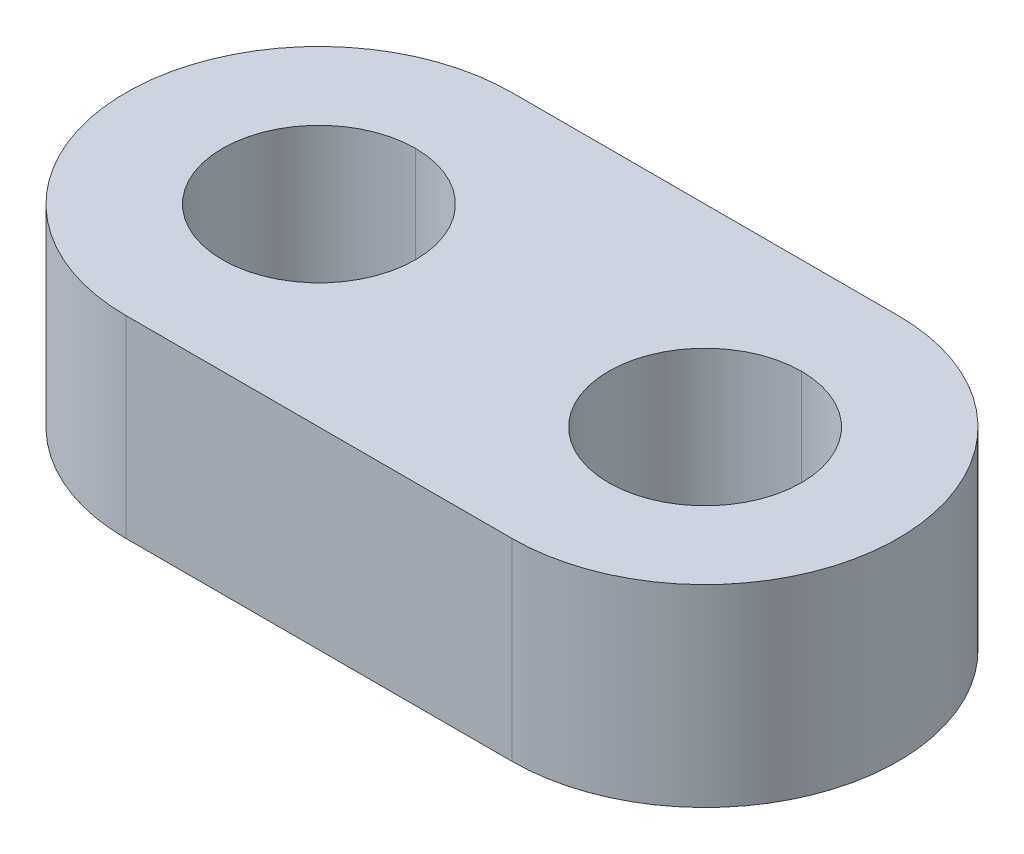
ISO-10303-21;
HEADER;
FILE_DESCRIPTION(('STEP AP214'),'2;1');
FILE_NAME('part.step','',(''),(''),'','','');
FILE_SCHEMA(('AUTOMOTIVE_DESIGN { 1 0 10303 214 1 1 1 1 }'));
ENDSEC;
DATA;
#1=APPLICATION_CONTEXT('core data for automotive mechanical design processes');
#2=APPLICATION_PROTOCOL_DEFINITION('international standard','automotive_design',2000,#1);
#3=PRODUCT_CONTEXT('',#1,'mechanical');
#4=PRODUCT('Part','Part','',(#3));
#5=PRODUCT_RELATED_PRODUCT_CATEGORY('part','',(#4));
#6=PRODUCT_DEFINITION_FORMATION('','',#4);
#7=PRODUCT_DEFINITION_CONTEXT('part definition',#1,'design');
#8=PRODUCT_DEFINITION('design','',#6,#7);
#9=PRODUCT_DEFINITION_SHAPE('','',#8);
#10=(LENGTH_UNIT() NAMED_UNIT(*) SI_UNIT(.MILLI.,.METRE.));
#11=(NAMED_UNIT(*) PLANE_ANGLE_UNIT() SI_UNIT($,.RADIAN.));
#12=(NAMED_UNIT(*) SI_UNIT($,.STERADIAN.) SOLID_ANGLE_UNIT());
#13=UNCERTAINTY_MEASURE_WITH_UNIT(LENGTH_MEASURE(1.E-05),#10,'distance_accuracy_value','');
#14=(GEOMETRIC_REPRESENTATION_CONTEXT(3) GLOBAL_UNCERTAINTY_ASSIGNED_CONTEXT((#13)) GLOBAL_UNIT_ASSIGNED_CONTEXT((#10,
#11,#12)) REPRESENTATION_CONTEXT('',''));
#15=CARTESIAN_POINT('',(0.,0.,0.));
#16=DIRECTION('',(0.,0.,1.));
#17=DIRECTION('',(1.,0.,0.));
#18=AXIS2_PLACEMENT_3D('',#15,#16,#17);
#19=CARTESIAN_POINT('',(4.,4.,0.));
#20=DIRECTION('',(0.,1.,0.));
#21=DIRECTION('',(0.,0.,1.));
#22=AXIS2_PLACEMENT_3D('',#19,#20,#21);
#23=CYLINDRICAL_SURFACE('',#22,2.);
#24=DIRECTION('',(0.,1.,0.));
#25=VECTOR('',#24,1.);
#26=CARTESIAN_POINT('',(4.,4.,-2.));
#27=LINE('',#26,#25);
#28=CARTESIAN_POINT('',(4.,0.,-2.));
#29=VERTEX_POINT('',#28);
#30=CARTESIAN_POINT('',(4.,4.,-2.));
#31=VERTEX_POINT('',#30);
#32=EDGE_CURVE('E134',#29,#31,#27,.T.);
#33=ORIENTED_EDGE('',*,*,#32,.F.);
#34=CARTESIAN_POINT('',(4.,0.,0.));
#35=DIRECTION('',(0.,1.,0.));
#36=DIRECTION('',(0.,0.,1.));
#37=AXIS2_PLACEMENT_3D('',#34,#35,#36);
#38=CIRCLE('',#37,2.);
#39=CARTESIAN_POINT('',(4.,0.,2.));
#40=VERTEX_POINT('',#39);
#41=EDGE_CURVE('E26',#40,#29,#38,.T.);
#42=ORIENTED_EDGE('',*,*,#41,.F.);
#43=DIRECTION('',(0.,1.,0.));
#44=VECTOR('',#43,1.);
#45=CARTESIAN_POINT('',(4.,4.,2.));
#46=LINE('',#45,#44);
#47=CARTESIAN_POINT('',(4.,4.,2.));
#48=VERTEX_POINT('',#47);
#49=EDGE_CURVE('E156',#40,#48,#46,.T.);
#50=ORIENTED_EDGE('',*,*,#49,.T.);
#51=CARTESIAN_POINT('',(4.,4.,0.));
#52=DIRECTION('',(0.,1.,0.));
#53=DIRECTION('',(0.,0.,1.));
#54=AXIS2_PLACEMENT_3D('',#51,#52,#53);
#55=CIRCLE('',#54,2.);
#56=EDGE_CURVE('E175',#48,#31,#55,.T.);
#57=ORIENTED_EDGE('',*,*,#56,.T.);
#58=EDGE_LOOP('',(#33,#42,#50,#57));
#59=FACE_BOUND('',#58,.T.);
#60=ADVANCED_FACE('F15',(#59),#23,.F.);
#61=CARTESIAN_POINT('',(-4.,4.,0.));
#62=DIRECTION('',(0.,1.,0.));
#63=DIRECTION('',(0.,0.,1.));
#64=AXIS2_PLACEMENT_3D('',#61,#62,#63);
#65=CYLINDRICAL_SURFACE('',#64,2.);
#66=DIRECTION('',(0.,1.,0.));
#67=VECTOR('',#66,1.);
#68=CARTESIAN_POINT('',(-4.,4.,-2.));
#69=LINE('',#68,#67);
#70=CARTESIAN_POINT('',(-4.,0.,-2.));
#71=VERTEX_POINT('',#70);
#72=CARTESIAN_POINT('',(-4.,4.,-2.));
#73=VERTEX_POINT('',#72);
#74=EDGE_CURVE('E142',#71,#73,#69,.T.);
#75=ORIENTED_EDGE('',*,*,#74,.F.);
#76=CARTESIAN_POINT('',(-4.,0.,0.));
#77=DIRECTION('',(0.,1.,0.));
#78=DIRECTION('',(0.,0.,1.));
#79=AXIS2_PLACEMENT_3D('',#76,#77,#78);
#80=CIRCLE('',#79,2.);
#81=CARTESIAN_POINT('',(-4.,0.,2.));
#82=VERTEX_POINT('',#81);
#83=EDGE_CURVE('E10',#82,#71,#80,.T.);
#84=ORIENTED_EDGE('',*,*,#83,.F.);
#85=DIRECTION('',(0.,1.,0.));
#86=VECTOR('',#85,1.);
#87=CARTESIAN_POINT('',(-4.,4.,2.));
#88=LINE('',#87,#86);
#89=CARTESIAN_POINT('',(-4.,4.,2.));
#90=VERTEX_POINT('',#89);
#91=EDGE_CURVE('E19',#82,#90,#88,.T.);
#92=ORIENTED_EDGE('',*,*,#91,.T.);
#93=CARTESIAN_POINT('',(-4.,4.,0.));
#94=DIRECTION('',(0.,1.,0.));
#95=DIRECTION('',(0.,0.,1.));
#96=AXIS2_PLACEMENT_3D('',#93,#94,#95);
#97=CIRCLE('',#96,2.);
#98=EDGE_CURVE('E74',#90,#73,#97,.T.);
#99=ORIENTED_EDGE('',*,*,#98,.T.);
#100=EDGE_LOOP('',(#75,#84,#92,#99));
#101=FACE_BOUND('',#100,.T.);
#102=ADVANCED_FACE('F204',(#101),#65,.F.);
#103=CARTESIAN_POINT('',(-4.,0.,0.));
#104=DIRECTION('',(0.,1.,0.));
#105=DIRECTION('',(1.,0.,0.));
#106=AXIS2_PLACEMENT_3D('',#103,#104,#105);
#107=PLANE('',#106);
#108=ORIENTED_EDGE('',*,*,#83,.T.);
#109=CARTESIAN_POINT('',(-4.,0.,0.));
#110=DIRECTION('',(0.,1.,0.));
#111=DIRECTION('',(0.,0.,1.));
#112=AXIS2_PLACEMENT_3D('',#109,#110,#111);
#113=CIRCLE('',#112,2.);
#114=EDGE_CURVE('E147',#71,#82,#113,.T.);
#115=ORIENTED_EDGE('',*,*,#114,.T.);
#116=EDGE_LOOP('',(#108,#115));
#117=FACE_BOUND('',#116,.T.);
#118=ORIENTED_EDGE('',*,*,#41,.T.);
#119=CARTESIAN_POINT('',(4.,0.,0.));
#120=DIRECTION('',(0.,1.,0.));
#121=DIRECTION('',(0.,0.,1.));
#122=AXIS2_PLACEMENT_3D('',#119,#120,#121);
#123=CIRCLE('',#122,2.);
#124=EDGE_CURVE('E166',#29,#40,#123,.T.);
#125=ORIENTED_EDGE('',*,*,#124,.T.);
#126=EDGE_LOOP('',(#118,#125));
#127=FACE_BOUND('',#126,.T.);
#128=CARTESIAN_POINT('',(-4.,0.,0.));
#129=DIRECTION('',(0.,1.,0.));
#130=DIRECTION('',(0.,0.,1.));
#131=AXIS2_PLACEMENT_3D('',#128,#129,#130);
#132=CIRCLE('',#131,4.);
#133=CARTESIAN_POINT('',(-4.,0.,-4.));
#134=VERTEX_POINT('',#133);
#135=CARTESIAN_POINT('',(-4.,0.,4.));
#136=VERTEX_POINT('',#135);
#137=EDGE_CURVE('E125',#134,#136,#132,.T.);
#138=ORIENTED_EDGE('',*,*,#137,.F.);
#139=DIRECTION('',(-1.,0.,0.));
#140=VECTOR('',#139,1.);
#141=CARTESIAN_POINT('',(-4.,0.,-4.));
#142=LINE('',#141,#140);
#143=CARTESIAN_POINT('',(4.,0.,-4.));
#144=VERTEX_POINT('',#143);
#145=EDGE_CURVE('E57',#144,#134,#142,.T.);
#146=ORIENTED_EDGE('',*,*,#145,.F.);
#147=CARTESIAN_POINT('',(4.,0.,0.));
#148=DIRECTION('',(0.,1.,0.));
#149=DIRECTION('',(0.,0.,1.));
#150=AXIS2_PLACEMENT_3D('',#147,#148,#149);
#151=CIRCLE('',#150,4.);
#152=CARTESIAN_POINT('',(4.,0.,4.));
#153=VERTEX_POINT('',#152);
#154=EDGE_CURVE('E90',#153,#144,#151,.T.);
#155=ORIENTED_EDGE('',*,*,#154,.F.);
#156=DIRECTION('',(1.,0.,0.));
#157=VECTOR('',#156,1.);
#158=CARTESIAN_POINT('',(-4.,0.,4.));
#159=LINE('',#158,#157);
#160=EDGE_CURVE('E141',#136,#153,#159,.T.);
#161=ORIENTED_EDGE('',*,*,#160,.F.);
#162=EDGE_LOOP('',(#138,#146,#155,#161));
#163=FACE_BOUND('',#162,.T.);
#164=ADVANCED_FACE('F17',(#117,#127,#163),#107,.F.);
#165=CARTESIAN_POINT('',(-4.,4.,0.));
#166=DIRECTION('',(0.,1.,0.));
#167=DIRECTION('',(1.,0.,0.));
#168=AXIS2_PLACEMENT_3D('',#165,#166,#167);
#169=PLANE('',#168);
#170=ORIENTED_EDGE('',*,*,#98,.F.);
#171=CARTESIAN_POINT('',(-4.,4.,0.));
#172=DIRECTION('',(0.,1.,0.));
#173=DIRECTION('',(0.,0.,1.));
#174=AXIS2_PLACEMENT_3D('',#171,#172,#173);
#175=CIRCLE('',#174,2.);
#176=EDGE_CURVE('E146',#73,#90,#175,.T.);
#177=ORIENTED_EDGE('',*,*,#176,.F.);
#178=EDGE_LOOP('',(#170,#177));
#179=FACE_BOUND('',#178,.T.);
#180=ORIENTED_EDGE('',*,*,#56,.F.);
#181=CARTESIAN_POINT('',(4.,4.,0.));
#182=DIRECTION('',(0.,1.,0.));
#183=DIRECTION('',(0.,0.,1.));
#184=AXIS2_PLACEMENT_3D('',#181,#182,#183);
#185=CIRCLE('',#184,2.);
#186=EDGE_CURVE('E160',#31,#48,#185,.T.);
#187=ORIENTED_EDGE('',*,*,#186,.F.);
#188=EDGE_LOOP('',(#180,#187));
#189=FACE_BOUND('',#188,.T.);
#190=CARTESIAN_POINT('',(-4.,4.,0.));
#191=DIRECTION('',(0.,1.,0.));
#192=DIRECTION('',(0.,0.,1.));
#193=AXIS2_PLACEMENT_3D('',#190,#191,#192);
#194=CIRCLE('',#193,4.);
#195=CARTESIAN_POINT('',(-4.,4.,-4.));
#196=VERTEX_POINT('',#195);
#197=CARTESIAN_POINT('',(-4.,4.,4.));
#198=VERTEX_POINT('',#197);
#199=EDGE_CURVE('E117',#196,#198,#194,.T.);
#200=ORIENTED_EDGE('',*,*,#199,.T.);
#201=DIRECTION('',(1.,0.,0.));
#202=VECTOR('',#201,1.);
#203=CARTESIAN_POINT('',(-4.,4.,4.));
#204=LINE('',#203,#202);
#205=CARTESIAN_POINT('',(4.,4.,4.));
#206=VERTEX_POINT('',#205);
#207=EDGE_CURVE('E107',#198,#206,#204,.T.);
#208=ORIENTED_EDGE('',*,*,#207,.T.);
#209=CARTESIAN_POINT('',(4.,4.,0.));
#210=DIRECTION('',(0.,1.,0.));
#211=DIRECTION('',(0.,0.,1.));
#212=AXIS2_PLACEMENT_3D('',#209,#210,#211);
#213=CIRCLE('',#212,4.);
#214=CARTESIAN_POINT('',(4.,4.,-4.));
#215=VERTEX_POINT('',#214);
#216=EDGE_CURVE('E138',#206,#215,#213,.T.);
#217=ORIENTED_EDGE('',*,*,#216,.T.);
#218=DIRECTION('',(-1.,0.,0.));
#219=VECTOR('',#218,1.);
#220=CARTESIAN_POINT('',(-4.,4.,-4.));
#221=LINE('',#220,#219);
#222=EDGE_CURVE('E41',#215,#196,#221,.T.);
#223=ORIENTED_EDGE('',*,*,#222,.T.);
#224=EDGE_LOOP('',(#200,#208,#217,#223));
#225=FACE_BOUND('',#224,.T.);
#226=ADVANCED_FACE('F118',(#179,#189,#225),#169,.T.);
#227=CARTESIAN_POINT('',(-4.,4.,-4.));
#228=DIRECTION('',(0.,0.,1.));
#229=DIRECTION('',(1.,0.,0.));
#230=AXIS2_PLACEMENT_3D('',#227,#228,#229);
#231=PLANE('',#230);
#232=ORIENTED_EDGE('',*,*,#145,.T.);
#233=DIRECTION('',(0.,-1.,0.));
#234=VECTOR('',#233,1.);
#235=CARTESIAN_POINT('',(-4.,4.,-4.));
#236=LINE('',#235,#234);
#237=EDGE_CURVE('E121',#196,#134,#236,.T.);
#238=ORIENTED_EDGE('',*,*,#237,.F.);
#239=ORIENTED_EDGE('',*,*,#222,.F.);
#240=DIRECTION('',(0.,-1.,0.));
#241=VECTOR('',#240,1.);
#242=CARTESIAN_POINT('',(4.,4.,-4.));
#243=LINE('',#242,#241);
#244=EDGE_CURVE('E176',#215,#144,#243,.T.);
#245=ORIENTED_EDGE('',*,*,#244,.T.);
#246=EDGE_LOOP('',(#232,#238,#239,#245));
#247=FACE_BOUND('',#246,.T.);
#248=ADVANCED_FACE('F192',(#247),#231,.F.);
#249=CARTESIAN_POINT('',(4.,4.,0.));
#250=DIRECTION('',(0.,-1.,0.));
#251=DIRECTION('',(0.,0.,-1.));
#252=AXIS2_PLACEMENT_3D('',#249,#250,#251);
#253=CYLINDRICAL_SURFACE('',#252,4.);
#254=ORIENTED_EDGE('',*,*,#154,.T.);
#255=ORIENTED_EDGE('',*,*,#244,.F.);
#256=ORIENTED_EDGE('',*,*,#216,.F.);
#257=DIRECTION('',(0.,-1.,0.));
#258=VECTOR('',#257,1.);
#259=CARTESIAN_POINT('',(4.,4.,4.));
#260=LINE('',#259,#258);
#261=EDGE_CURVE('E113',#206,#153,#260,.T.);
#262=ORIENTED_EDGE('',*,*,#261,.T.);
#263=EDGE_LOOP('',(#254,#255,#256,#262));
#264=FACE_BOUND('',#263,.T.);
#265=ADVANCED_FACE('F191',(#264),#253,.T.);
#266=CARTESIAN_POINT('',(-4.,4.,4.));
#267=DIRECTION('',(0.,0.,-1.));
#268=DIRECTION('',(0.,-1.,0.));
#269=AXIS2_PLACEMENT_3D('',#266,#267,#268);
#270=PLANE('',#269);
#271=ORIENTED_EDGE('',*,*,#160,.T.);
#272=ORIENTED_EDGE('',*,*,#261,.F.);
#273=ORIENTED_EDGE('',*,*,#207,.F.);
#274=DIRECTION('',(0.,-1.,0.));
#275=VECTOR('',#274,1.);
#276=CARTESIAN_POINT('',(-4.,4.,4.));
#277=LINE('',#276,#275);
#278=EDGE_CURVE('E111',#198,#136,#277,.T.);
#279=ORIENTED_EDGE('',*,*,#278,.T.);
#280=EDGE_LOOP('',(#271,#272,#273,#279));
#281=FACE_BOUND('',#280,.T.);
#282=ADVANCED_FACE('F109',(#281),#270,.F.);
#283=CARTESIAN_POINT('',(-4.,4.,0.));
#284=DIRECTION('',(0.,-1.,0.));
#285=DIRECTION('',(0.,0.,-1.));
#286=AXIS2_PLACEMENT_3D('',#283,#284,#285);
#287=CYLINDRICAL_SURFACE('',#286,4.);
#288=ORIENTED_EDGE('',*,*,#137,.T.);
#289=ORIENTED_EDGE('',*,*,#278,.F.);
#290=ORIENTED_EDGE('',*,*,#199,.F.);
#291=ORIENTED_EDGE('',*,*,#237,.T.);
#292=EDGE_LOOP('',(#288,#289,#290,#291));
#293=FACE_BOUND('',#292,.T.);
#294=ADVANCED_FACE('F123',(#293),#287,.T.);
#295=CARTESIAN_POINT('',(-4.,4.,0.));
#296=DIRECTION('',(0.,1.,0.));
#297=DIRECTION('',(0.,0.,1.));
#298=AXIS2_PLACEMENT_3D('',#295,#296,#297);
#299=CYLINDRICAL_SURFACE('',#298,2.);
#300=ORIENTED_EDGE('',*,*,#114,.F.);
#301=ORIENTED_EDGE('',*,*,#74,.T.);
#302=ORIENTED_EDGE('',*,*,#176,.T.);
#303=ORIENTED_EDGE('',*,*,#91,.F.);
#304=EDGE_LOOP('',(#300,#301,#302,#303));
#305=FACE_BOUND('',#304,.T.);
#306=ADVANCED_FACE('F214',(#305),#299,.F.);
#307=CARTESIAN_POINT('',(4.,4.,0.));
#308=DIRECTION('',(0.,1.,0.));
#309=DIRECTION('',(0.,0.,1.));
#310=AXIS2_PLACEMENT_3D('',#307,#308,#309);
#311=CYLINDRICAL_SURFACE('',#310,2.);
#312=ORIENTED_EDGE('',*,*,#124,.F.);
#313=ORIENTED_EDGE('',*,*,#32,.T.);
#314=ORIENTED_EDGE('',*,*,#186,.T.);
#315=ORIENTED_EDGE('',*,*,#49,.F.);
#316=EDGE_LOOP('',(#312,#313,#314,#315));
#317=FACE_BOUND('',#316,.T.);
#318=ADVANCED_FACE('F216',(#317),#311,.F.);
#319=CLOSED_SHELL('',(#60,#102,#164,#226,#248,#265,#282,#294,#306,#318));
#320=MANIFOLD_SOLID_BREP('B1',#319);
#321=ADVANCED_BREP_SHAPE_REPRESENTATION('',(#18,#320),#14);
#322=SHAPE_DEFINITION_REPRESENTATION(#9,#321);
ENDSEC;
END-ISO-10303-21;
